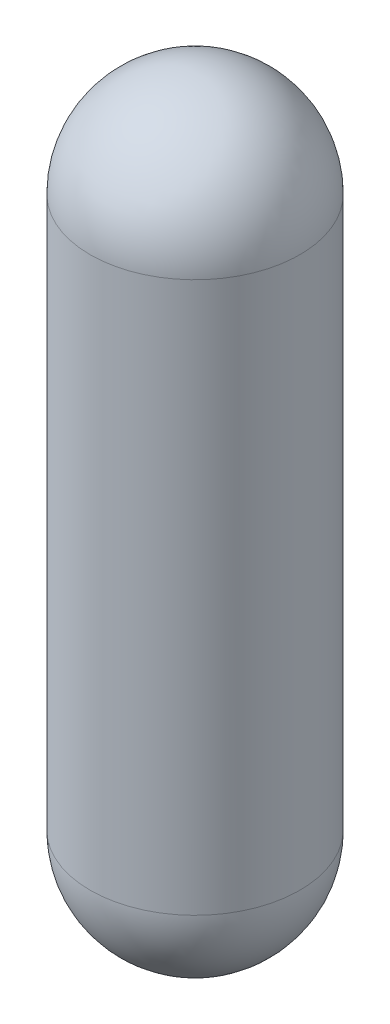
ISO-10303-21;
HEADER;
FILE_DESCRIPTION(('STEP AP214'),'2;1');
FILE_NAME('part.step','',(''),(''),'','','');
FILE_SCHEMA(('AUTOMOTIVE_DESIGN { 1 0 10303 214 1 1 1 1 }'));
ENDSEC;
DATA;
#1=APPLICATION_CONTEXT('core data for automotive mechanical design processes');
#2=APPLICATION_PROTOCOL_DEFINITION('international standard','automotive_design',2000,#1);
#3=PRODUCT_CONTEXT('',#1,'mechanical');
#4=PRODUCT('Part','Part','',(#3));
#5=PRODUCT_RELATED_PRODUCT_CATEGORY('part','',(#4));
#6=PRODUCT_DEFINITION_FORMATION('','',#4);
#7=PRODUCT_DEFINITION_CONTEXT('part definition',#1,'design');
#8=PRODUCT_DEFINITION('design','',#6,#7);
#9=PRODUCT_DEFINITION_SHAPE('','',#8);
#10=(LENGTH_UNIT() NAMED_UNIT(*) SI_UNIT(.MILLI.,.METRE.));
#11=(NAMED_UNIT(*) PLANE_ANGLE_UNIT() SI_UNIT($,.RADIAN.));
#12=(NAMED_UNIT(*) SI_UNIT($,.STERADIAN.) SOLID_ANGLE_UNIT());
#13=UNCERTAINTY_MEASURE_WITH_UNIT(LENGTH_MEASURE(1.E-05),#10,'distance_accuracy_value','');
#14=(GEOMETRIC_REPRESENTATION_CONTEXT(3) GLOBAL_UNCERTAINTY_ASSIGNED_CONTEXT((#13)) GLOBAL_UNIT_ASSIGNED_CONTEXT((#10,
#11,#12)) REPRESENTATION_CONTEXT('',''));
#15=CARTESIAN_POINT('',(0.,0.,0.));
#16=DIRECTION('',(0.,0.,1.));
#17=DIRECTION('',(1.,0.,0.));
#18=AXIS2_PLACEMENT_3D('',#15,#16,#17);
#19=CARTESIAN_POINT('',(0.,266.7,0.));
#20=DIRECTION('',(0.,-1.,0.));
#21=DIRECTION('',(0.,0.,-1.));
#22=AXIS2_PLACEMENT_3D('',#19,#20,#21);
#23=CYLINDRICAL_SURFACE('',#22,50.8);
#24=CARTESIAN_POINT('',(0.,266.7,0.));
#25=DIRECTION('',(0.,1.,0.));
#26=DIRECTION('',(0.,0.,1.));
#27=AXIS2_PLACEMENT_3D('',#24,#25,#26);
#28=CIRCLE('',#27,50.8);
#29=CARTESIAN_POINT('',(0.,266.7,50.8));
#30=VERTEX_POINT('',#29);
#31=EDGE_CURVE('E10',#30,#30,#28,.T.);
#32=ORIENTED_EDGE('',*,*,#31,.F.);
#33=EDGE_LOOP('',(#32));
#34=FACE_BOUND('',#33,.T.);
#35=CARTESIAN_POINT('',(0.,2.22044604925031E-13,0.));
#36=DIRECTION('',(0.,1.,0.));
#37=DIRECTION('',(0.,0.,1.));
#38=AXIS2_PLACEMENT_3D('',#35,#36,#37);
#39=CIRCLE('',#38,50.8);
#40=CARTESIAN_POINT('',(0.,2.08827664155684E-13,50.8));
#41=VERTEX_POINT('',#40);
#42=EDGE_CURVE('E38',#41,#41,#39,.T.);
#43=ORIENTED_EDGE('',*,*,#42,.T.);
#44=EDGE_LOOP('',(#43));
#45=FACE_BOUND('',#44,.T.);
#46=ADVANCED_FACE('F32',(#34,#45),#23,.T.);
#47=CARTESIAN_POINT('',(0.,0.,0.));
#48=DIRECTION('',(0.,1.,0.));
#49=DIRECTION('',(0.,0.,1.));
#50=AXIS2_PLACEMENT_3D('',#47,#48,#49);
#51=SPHERICAL_SURFACE('',#50,50.8);
#52=ORIENTED_EDGE('',*,*,#42,.F.);
#53=EDGE_LOOP('',(#52));
#54=FACE_BOUND('',#53,.T.);
#55=ADVANCED_FACE('F45',(#54),#51,.T.);
#56=CARTESIAN_POINT('',(0.,266.7,0.));
#57=DIRECTION('',(0.,1.,0.));
#58=DIRECTION('',(0.,0.,-1.));
#59=AXIS2_PLACEMENT_3D('',#56,#57,#58);
#60=SPHERICAL_SURFACE('',#59,50.7999999999999);
#61=ORIENTED_EDGE('',*,*,#31,.T.);
#62=EDGE_LOOP('',(#61));
#63=FACE_BOUND('',#62,.T.);
#64=ADVANCED_FACE('F47',(#63),#60,.T.);
#65=CLOSED_SHELL('',(#46,#55,#64));
#66=MANIFOLD_SOLID_BREP('B2',#65);
#67=ADVANCED_BREP_SHAPE_REPRESENTATION('',(#18,#66),#14);
#68=SHAPE_DEFINITION_REPRESENTATION(#9,#67);
ENDSEC;
END-ISO-10303-21;
